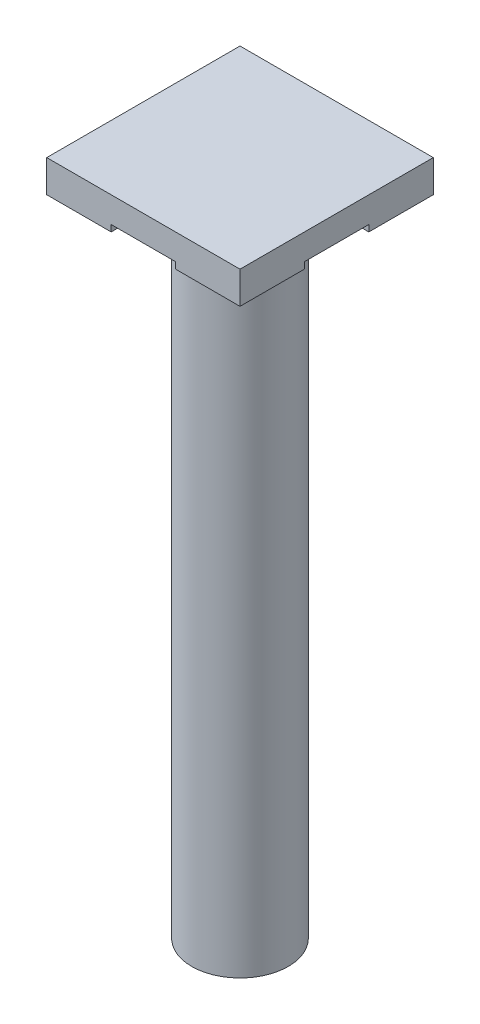
ISO-10303-21;
HEADER;
FILE_DESCRIPTION(('STEP AP214'),'2;1');
FILE_NAME('part.step','',(''),(''),'','','');
FILE_SCHEMA(('AUTOMOTIVE_DESIGN { 1 0 10303 214 1 1 1 1 }'));
ENDSEC;
DATA;
#1=APPLICATION_CONTEXT('core data for automotive mechanical design processes');
#2=APPLICATION_PROTOCOL_DEFINITION('international standard','automotive_design',2000,#1);
#3=PRODUCT_CONTEXT('',#1,'mechanical');
#4=PRODUCT('Part','Part','',(#3));
#5=PRODUCT_RELATED_PRODUCT_CATEGORY('part','',(#4));
#6=PRODUCT_DEFINITION_FORMATION('','',#4);
#7=PRODUCT_DEFINITION_CONTEXT('part definition',#1,'design');
#8=PRODUCT_DEFINITION('design','',#6,#7);
#9=PRODUCT_DEFINITION_SHAPE('','',#8);
#10=(LENGTH_UNIT() NAMED_UNIT(*) SI_UNIT(.MILLI.,.METRE.));
#11=(NAMED_UNIT(*) PLANE_ANGLE_UNIT() SI_UNIT($,.RADIAN.));
#12=(NAMED_UNIT(*) SI_UNIT($,.STERADIAN.) SOLID_ANGLE_UNIT());
#13=UNCERTAINTY_MEASURE_WITH_UNIT(LENGTH_MEASURE(1.E-05),#10,'distance_accuracy_value','');
#14=(GEOMETRIC_REPRESENTATION_CONTEXT(3) GLOBAL_UNCERTAINTY_ASSIGNED_CONTEXT((#13)) GLOBAL_UNIT_ASSIGNED_CONTEXT((#10,
#11,#12)) REPRESENTATION_CONTEXT('',''));
#15=CARTESIAN_POINT('',(0.,0.,0.));
#16=DIRECTION('',(0.,0.,1.));
#17=DIRECTION('',(1.,0.,0.));
#18=AXIS2_PLACEMENT_3D('',#15,#16,#17);
#19=CARTESIAN_POINT('',(0.,254.,0.));
#20=DIRECTION('',(0.,-1.,0.));
#21=DIRECTION('',(0.,0.,-1.));
#22=AXIS2_PLACEMENT_3D('',#19,#20,#21);
#23=CYLINDRICAL_SURFACE('',#22,19.05);
#24=CARTESIAN_POINT('',(0.,254.,0.));
#25=DIRECTION('',(0.,1.,0.));
#26=DIRECTION('',(0.,0.,1.));
#27=AXIS2_PLACEMENT_3D('',#24,#25,#26);
#28=CIRCLE('',#27,19.05);
#29=CARTESIAN_POINT('',(0.,254.,19.05));
#30=VERTEX_POINT('',#29);
#31=EDGE_CURVE('E11',#30,#30,#28,.T.);
#32=ORIENTED_EDGE('',*,*,#31,.F.);
#33=EDGE_LOOP('',(#32));
#34=FACE_BOUND('',#33,.T.);
#35=CARTESIAN_POINT('',(0.,0.,0.));
#36=DIRECTION('',(0.,1.,0.));
#37=DIRECTION('',(0.,0.,1.));
#38=AXIS2_PLACEMENT_3D('',#35,#36,#37);
#39=CIRCLE('',#38,19.05);
#40=CARTESIAN_POINT('',(0.,0.,19.05));
#41=VERTEX_POINT('',#40);
#42=EDGE_CURVE('E40',#41,#41,#39,.T.);
#43=ORIENTED_EDGE('',*,*,#42,.T.);
#44=EDGE_LOOP('',(#43));
#45=FACE_BOUND('',#44,.T.);
#46=ADVANCED_FACE('F37',(#34,#45),#23,.T.);
#47=CARTESIAN_POINT('',(0.,0.,0.));
#48=DIRECTION('',(0.,1.,0.));
#49=DIRECTION('',(0.,0.,1.));
#50=AXIS2_PLACEMENT_3D('',#47,#48,#49);
#51=PLANE('',#50);
#52=ORIENTED_EDGE('',*,*,#42,.F.);
#53=EDGE_LOOP('',(#52));
#54=FACE_BOUND('',#53,.T.);
#55=ADVANCED_FACE('F330',(#54),#51,.F.);
#56=CARTESIAN_POINT('',(-38.1,266.7,-38.1));
#57=DIRECTION('',(1.,0.,0.));
#58=DIRECTION('',(0.,0.,-1.));
#59=AXIS2_PLACEMENT_3D('',#56,#57,#58);
#60=PLANE('',#59);
#61=DIRECTION('',(0.,0.,-1.));
#62=VECTOR('',#61,1.);
#63=CARTESIAN_POINT('',(-38.1,256.54,12.7));
#64=LINE('',#63,#62);
#65=CARTESIAN_POINT('',(-38.1,256.54,12.7));
#66=VERTEX_POINT('',#65);
#67=CARTESIAN_POINT('',(-38.1,256.54,-12.7));
#68=VERTEX_POINT('',#67);
#69=EDGE_CURVE('E185',#66,#68,#64,.T.);
#70=ORIENTED_EDGE('',*,*,#69,.F.);
#71=DIRECTION('',(0.,-1.,0.));
#72=VECTOR('',#71,1.);
#73=CARTESIAN_POINT('',(-38.1,256.54,12.7));
#74=LINE('',#73,#72);
#75=CARTESIAN_POINT('',(-38.1,254.,12.7));
#76=VERTEX_POINT('',#75);
#77=EDGE_CURVE('E606',#66,#76,#74,.T.);
#78=ORIENTED_EDGE('',*,*,#77,.T.);
#79=DIRECTION('',(0.,0.,1.));
#80=VECTOR('',#79,1.);
#81=CARTESIAN_POINT('',(-38.1,254.,-38.1));
#82=LINE('',#81,#80);
#83=CARTESIAN_POINT('',(-38.1,254.,38.1));
#84=VERTEX_POINT('',#83);
#85=EDGE_CURVE('E304',#76,#84,#82,.T.);
#86=ORIENTED_EDGE('',*,*,#85,.T.);
#87=DIRECTION('',(0.,-1.,0.));
#88=VECTOR('',#87,1.);
#89=CARTESIAN_POINT('',(-38.1,266.7,38.1));
#90=LINE('',#89,#88);
#91=CARTESIAN_POINT('',(-38.1,266.7,38.1));
#92=VERTEX_POINT('',#91);
#93=EDGE_CURVE('E322',#92,#84,#90,.T.);
#94=ORIENTED_EDGE('',*,*,#93,.F.);
#95=DIRECTION('',(0.,0.,1.));
#96=VECTOR('',#95,1.);
#97=CARTESIAN_POINT('',(-38.1,266.7,-38.1));
#98=LINE('',#97,#96);
#99=CARTESIAN_POINT('',(-38.1,266.7,-38.1));
#100=VERTEX_POINT('',#99);
#101=EDGE_CURVE('E291',#100,#92,#98,.T.);
#102=ORIENTED_EDGE('',*,*,#101,.F.);
#103=DIRECTION('',(0.,-1.,0.));
#104=VECTOR('',#103,1.);
#105=CARTESIAN_POINT('',(-38.1,266.7,-38.1));
#106=LINE('',#105,#104);
#107=CARTESIAN_POINT('',(-38.1,254.,-38.1));
#108=VERTEX_POINT('',#107);
#109=EDGE_CURVE('E301',#100,#108,#106,.T.);
#110=ORIENTED_EDGE('',*,*,#109,.T.);
#111=CARTESIAN_POINT('',(-38.1,254.,-12.7));
#112=VERTEX_POINT('',#111);
#113=EDGE_CURVE('E200',#108,#112,#82,.T.);
#114=ORIENTED_EDGE('',*,*,#113,.T.);
#115=DIRECTION('',(0.,-1.,0.));
#116=VECTOR('',#115,1.);
#117=CARTESIAN_POINT('',(-38.1,256.54,-12.7));
#118=LINE('',#117,#116);
#119=EDGE_CURVE('E178',#68,#112,#118,.T.);
#120=ORIENTED_EDGE('',*,*,#119,.F.);
#121=EDGE_LOOP('',(#70,#78,#86,#94,#102,#110,#114,#120));
#122=FACE_BOUND('',#121,.T.);
#123=ADVANCED_FACE('F197',(#122),#60,.F.);
#124=CARTESIAN_POINT('',(-38.1,266.7,38.1));
#125=DIRECTION('',(0.,0.,-1.));
#126=DIRECTION('',(-1.,0.,0.));
#127=AXIS2_PLACEMENT_3D('',#124,#125,#126);
#128=PLANE('',#127);
#129=DIRECTION('',(1.,0.,0.));
#130=VECTOR('',#129,1.);
#131=CARTESIAN_POINT('',(-38.1,254.,38.1));
#132=LINE('',#131,#130);
#133=CARTESIAN_POINT('',(-12.7,254.,38.1));
#134=VERTEX_POINT('',#133);
#135=EDGE_CURVE('E305',#84,#134,#132,.T.);
#136=ORIENTED_EDGE('',*,*,#135,.T.);
#137=DIRECTION('',(0.,-1.,0.));
#138=VECTOR('',#137,1.);
#139=CARTESIAN_POINT('',(-12.7,256.54,38.1));
#140=LINE('',#139,#138);
#141=CARTESIAN_POINT('',(-12.7,256.54,38.1));
#142=VERTEX_POINT('',#141);
#143=EDGE_CURVE('E215',#142,#134,#140,.T.);
#144=ORIENTED_EDGE('',*,*,#143,.F.);
#145=DIRECTION('',(-1.,0.,0.));
#146=VECTOR('',#145,1.);
#147=CARTESIAN_POINT('',(-12.7,256.54,38.1));
#148=LINE('',#147,#146);
#149=CARTESIAN_POINT('',(12.7,256.54,38.1));
#150=VERTEX_POINT('',#149);
#151=EDGE_CURVE('E209',#150,#142,#148,.T.);
#152=ORIENTED_EDGE('',*,*,#151,.F.);
#153=DIRECTION('',(0.,-1.,0.));
#154=VECTOR('',#153,1.);
#155=CARTESIAN_POINT('',(12.7,256.54,38.1));
#156=LINE('',#155,#154);
#157=CARTESIAN_POINT('',(12.7,254.,38.1));
#158=VERTEX_POINT('',#157);
#159=EDGE_CURVE('E212',#150,#158,#156,.T.);
#160=ORIENTED_EDGE('',*,*,#159,.T.);
#161=CARTESIAN_POINT('',(38.1,254.,38.1));
#162=VERTEX_POINT('',#161);
#163=EDGE_CURVE('E303',#158,#162,#132,.T.);
#164=ORIENTED_EDGE('',*,*,#163,.T.);
#165=DIRECTION('',(0.,-1.,0.));
#166=VECTOR('',#165,1.);
#167=CARTESIAN_POINT('',(38.1,266.7,38.1));
#168=LINE('',#167,#166);
#169=CARTESIAN_POINT('',(38.1,266.7,38.1));
#170=VERTEX_POINT('',#169);
#171=EDGE_CURVE('E319',#170,#162,#168,.T.);
#172=ORIENTED_EDGE('',*,*,#171,.F.);
#173=DIRECTION('',(1.,0.,0.));
#174=VECTOR('',#173,1.);
#175=CARTESIAN_POINT('',(-38.1,266.7,38.1));
#176=LINE('',#175,#174);
#177=EDGE_CURVE('E294',#92,#170,#176,.T.);
#178=ORIENTED_EDGE('',*,*,#177,.F.);
#179=ORIENTED_EDGE('',*,*,#93,.T.);
#180=EDGE_LOOP('',(#136,#144,#152,#160,#164,#172,#178,#179));
#181=FACE_BOUND('',#180,.T.);
#182=ADVANCED_FACE('F336',(#181),#128,.F.);
#183=CARTESIAN_POINT('',(38.1,266.7,-38.1));
#184=DIRECTION('',(-1.,0.,0.));
#185=DIRECTION('',(0.,0.,1.));
#186=AXIS2_PLACEMENT_3D('',#183,#184,#185);
#187=PLANE('',#186);
#188=DIRECTION('',(0.,0.,1.));
#189=VECTOR('',#188,1.);
#190=CARTESIAN_POINT('',(38.1,256.54,12.7));
#191=LINE('',#190,#189);
#192=CARTESIAN_POINT('',(38.1,256.54,-12.7));
#193=VERTEX_POINT('',#192);
#194=CARTESIAN_POINT('',(38.1,256.54,12.7));
#195=VERTEX_POINT('',#194);
#196=EDGE_CURVE('E249',#193,#195,#191,.T.);
#197=ORIENTED_EDGE('',*,*,#196,.F.);
#198=DIRECTION('',(0.,-1.,0.));
#199=VECTOR('',#198,1.);
#200=CARTESIAN_POINT('',(38.1,256.54,-12.7));
#201=LINE('',#200,#199);
#202=CARTESIAN_POINT('',(38.1,254.,-12.7));
#203=VERTEX_POINT('',#202);
#204=EDGE_CURVE('E242',#193,#203,#201,.T.);
#205=ORIENTED_EDGE('',*,*,#204,.T.);
#206=DIRECTION('',(0.,0.,-1.));
#207=VECTOR('',#206,1.);
#208=CARTESIAN_POINT('',(38.1,254.,-38.1));
#209=LINE('',#208,#207);
#210=CARTESIAN_POINT('',(38.1,254.,-38.1));
#211=VERTEX_POINT('',#210);
#212=EDGE_CURVE('E308',#203,#211,#209,.T.);
#213=ORIENTED_EDGE('',*,*,#212,.T.);
#214=DIRECTION('',(0.,-1.,0.));
#215=VECTOR('',#214,1.);
#216=CARTESIAN_POINT('',(38.1,266.7,-38.1));
#217=LINE('',#216,#215);
#218=CARTESIAN_POINT('',(38.1,266.7,-38.1));
#219=VERTEX_POINT('',#218);
#220=EDGE_CURVE('E316',#219,#211,#217,.T.);
#221=ORIENTED_EDGE('',*,*,#220,.F.);
#222=DIRECTION('',(0.,0.,-1.));
#223=VECTOR('',#222,1.);
#224=CARTESIAN_POINT('',(38.1,266.7,-38.1));
#225=LINE('',#224,#223);
#226=EDGE_CURVE('E297',#170,#219,#225,.T.);
#227=ORIENTED_EDGE('',*,*,#226,.F.);
#228=ORIENTED_EDGE('',*,*,#171,.T.);
#229=CARTESIAN_POINT('',(38.1,254.,12.7));
#230=VERTEX_POINT('',#229);
#231=EDGE_CURVE('E309',#162,#230,#209,.T.);
#232=ORIENTED_EDGE('',*,*,#231,.T.);
#233=DIRECTION('',(0.,-1.,0.));
#234=VECTOR('',#233,1.);
#235=CARTESIAN_POINT('',(38.1,256.54,12.7));
#236=LINE('',#235,#234);
#237=EDGE_CURVE('E59',#195,#230,#236,.T.);
#238=ORIENTED_EDGE('',*,*,#237,.F.);
#239=EDGE_LOOP('',(#197,#205,#213,#221,#227,#228,#232,#238));
#240=FACE_BOUND('',#239,.T.);
#241=ADVANCED_FACE('F342',(#240),#187,.F.);
#242=CARTESIAN_POINT('',(-38.1,266.7,-38.1));
#243=DIRECTION('',(0.,0.,1.));
#244=DIRECTION('',(1.,0.,0.));
#245=AXIS2_PLACEMENT_3D('',#242,#243,#244);
#246=PLANE('',#245);
#247=DIRECTION('',(1.,0.,0.));
#248=VECTOR('',#247,1.);
#249=CARTESIAN_POINT('',(-12.7,256.54,-38.1));
#250=LINE('',#249,#248);
#251=CARTESIAN_POINT('',(-12.7,256.54,-38.1));
#252=VERTEX_POINT('',#251);
#253=CARTESIAN_POINT('',(12.7,256.54,-38.1));
#254=VERTEX_POINT('',#253);
#255=EDGE_CURVE('E286',#252,#254,#250,.T.);
#256=ORIENTED_EDGE('',*,*,#255,.F.);
#257=DIRECTION('',(0.,-1.,0.));
#258=VECTOR('',#257,1.);
#259=CARTESIAN_POINT('',(-12.7,256.54,-38.1));
#260=LINE('',#259,#258);
#261=CARTESIAN_POINT('',(-12.7,254.,-38.1));
#262=VERTEX_POINT('',#261);
#263=EDGE_CURVE('E263',#252,#262,#260,.T.);
#264=ORIENTED_EDGE('',*,*,#263,.T.);
#265=DIRECTION('',(-1.,0.,0.));
#266=VECTOR('',#265,1.);
#267=CARTESIAN_POINT('',(-38.1,254.,-38.1));
#268=LINE('',#267,#266);
#269=EDGE_CURVE('E312',#262,#108,#268,.T.);
#270=ORIENTED_EDGE('',*,*,#269,.T.);
#271=ORIENTED_EDGE('',*,*,#109,.F.);
#272=DIRECTION('',(-1.,0.,0.));
#273=VECTOR('',#272,1.);
#274=CARTESIAN_POINT('',(-38.1,266.7,-38.1));
#275=LINE('',#274,#273);
#276=EDGE_CURVE('E299',#219,#100,#275,.T.);
#277=ORIENTED_EDGE('',*,*,#276,.F.);
#278=ORIENTED_EDGE('',*,*,#220,.T.);
#279=CARTESIAN_POINT('',(12.7,254.,-38.1));
#280=VERTEX_POINT('',#279);
#281=EDGE_CURVE('E295',#211,#280,#268,.T.);
#282=ORIENTED_EDGE('',*,*,#281,.T.);
#283=DIRECTION('',(0.,-1.,0.));
#284=VECTOR('',#283,1.);
#285=CARTESIAN_POINT('',(12.7,256.54,-38.1));
#286=LINE('',#285,#284);
#287=EDGE_CURVE('E267',#254,#280,#286,.T.);
#288=ORIENTED_EDGE('',*,*,#287,.F.);
#289=EDGE_LOOP('',(#256,#264,#270,#271,#277,#278,#282,#288));
#290=FACE_BOUND('',#289,.T.);
#291=ADVANCED_FACE('F345',(#290),#246,.F.);
#292=CARTESIAN_POINT('',(0.,266.7,0.));
#293=DIRECTION('',(0.,1.,0.));
#294=DIRECTION('',(0.,0.,1.));
#295=AXIS2_PLACEMENT_3D('',#292,#293,#294);
#296=PLANE('',#295);
#297=ORIENTED_EDGE('',*,*,#101,.T.);
#298=ORIENTED_EDGE('',*,*,#177,.T.);
#299=ORIENTED_EDGE('',*,*,#226,.T.);
#300=ORIENTED_EDGE('',*,*,#276,.T.);
#301=EDGE_LOOP('',(#297,#298,#299,#300));
#302=FACE_BOUND('',#301,.T.);
#303=ADVANCED_FACE('F349',(#302),#296,.T.);
#304=CARTESIAN_POINT('',(0.,254.,0.));
#305=DIRECTION('',(0.,1.,0.));
#306=DIRECTION('',(0.,0.,1.));
#307=AXIS2_PLACEMENT_3D('',#304,#305,#306);
#308=PLANE('',#307);
#309=ORIENTED_EDGE('',*,*,#31,.T.);
#310=EDGE_LOOP('',(#309));
#311=FACE_BOUND('',#310,.T.);
#312=ORIENTED_EDGE('',*,*,#85,.F.);
#313=DIRECTION('',(-1.,0.,0.));
#314=VECTOR('',#313,1.);
#315=CARTESIAN_POINT('',(-38.1,254.,12.7));
#316=LINE('',#315,#314);
#317=CARTESIAN_POINT('',(-29.21,254.,12.7));
#318=VERTEX_POINT('',#317);
#319=EDGE_CURVE('E194',#318,#76,#316,.T.);
#320=ORIENTED_EDGE('',*,*,#319,.F.);
#321=DIRECTION('',(0.,0.,1.));
#322=VECTOR('',#321,1.);
#323=CARTESIAN_POINT('',(-29.21,254.,12.7));
#324=LINE('',#323,#322);
#325=CARTESIAN_POINT('',(-29.21,254.,-12.7));
#326=VERTEX_POINT('',#325);
#327=EDGE_CURVE('E611',#326,#318,#324,.T.);
#328=ORIENTED_EDGE('',*,*,#327,.F.);
#329=DIRECTION('',(1.,0.,0.));
#330=VECTOR('',#329,1.);
#331=CARTESIAN_POINT('',(-38.1,254.,-12.7));
#332=LINE('',#331,#330);
#333=EDGE_CURVE('E225',#112,#326,#332,.T.);
#334=ORIENTED_EDGE('',*,*,#333,.F.);
#335=ORIENTED_EDGE('',*,*,#113,.F.);
#336=ORIENTED_EDGE('',*,*,#269,.F.);
#337=DIRECTION('',(0.,0.,-1.));
#338=VECTOR('',#337,1.);
#339=CARTESIAN_POINT('',(-12.7,254.,-38.1));
#340=LINE('',#339,#338);
#341=CARTESIAN_POINT('',(-12.7,254.,-29.21));
#342=VERTEX_POINT('',#341);
#343=EDGE_CURVE('E245',#342,#262,#340,.T.);
#344=ORIENTED_EDGE('',*,*,#343,.F.);
#345=DIRECTION('',(-1.,0.,0.));
#346=VECTOR('',#345,1.);
#347=CARTESIAN_POINT('',(-12.7,254.,-29.21));
#348=LINE('',#347,#346);
#349=CARTESIAN_POINT('',(12.7,254.,-29.21));
#350=VERTEX_POINT('',#349);
#351=EDGE_CURVE('E273',#350,#342,#348,.T.);
#352=ORIENTED_EDGE('',*,*,#351,.F.);
#353=DIRECTION('',(0.,0.,1.));
#354=VECTOR('',#353,1.);
#355=CARTESIAN_POINT('',(12.7,254.,-38.1));
#356=LINE('',#355,#354);
#357=EDGE_CURVE('E276',#280,#350,#356,.T.);
#358=ORIENTED_EDGE('',*,*,#357,.F.);
#359=ORIENTED_EDGE('',*,*,#281,.F.);
#360=ORIENTED_EDGE('',*,*,#212,.F.);
#361=DIRECTION('',(1.,0.,0.));
#362=VECTOR('',#361,1.);
#363=CARTESIAN_POINT('',(38.1,254.,-12.7));
#364=LINE('',#363,#362);
#365=CARTESIAN_POINT('',(29.21,254.,-12.7));
#366=VERTEX_POINT('',#365);
#367=EDGE_CURVE('E246',#366,#203,#364,.T.);
#368=ORIENTED_EDGE('',*,*,#367,.F.);
#369=DIRECTION('',(0.,0.,-1.));
#370=VECTOR('',#369,1.);
#371=CARTESIAN_POINT('',(29.21,254.,12.7));
#372=LINE('',#371,#370);
#373=CARTESIAN_POINT('',(29.21,254.,12.7));
#374=VERTEX_POINT('',#373);
#375=EDGE_CURVE('E248',#374,#366,#372,.T.);
#376=ORIENTED_EDGE('',*,*,#375,.F.);
#377=DIRECTION('',(-1.,0.,0.));
#378=VECTOR('',#377,1.);
#379=CARTESIAN_POINT('',(38.1,254.,12.7));
#380=LINE('',#379,#378);
#381=EDGE_CURVE('E217',#230,#374,#380,.T.);
#382=ORIENTED_EDGE('',*,*,#381,.F.);
#383=ORIENTED_EDGE('',*,*,#231,.F.);
#384=ORIENTED_EDGE('',*,*,#163,.F.);
#385=DIRECTION('',(0.,0.,1.));
#386=VECTOR('',#385,1.);
#387=CARTESIAN_POINT('',(12.7,254.,38.1));
#388=LINE('',#387,#386);
#389=CARTESIAN_POINT('',(12.7,254.,29.21));
#390=VERTEX_POINT('',#389);
#391=EDGE_CURVE('E218',#390,#158,#388,.T.);
#392=ORIENTED_EDGE('',*,*,#391,.F.);
#393=DIRECTION('',(1.,0.,0.));
#394=VECTOR('',#393,1.);
#395=CARTESIAN_POINT('',(-12.7,254.,29.21));
#396=LINE('',#395,#394);
#397=CARTESIAN_POINT('',(-12.7,254.,29.21));
#398=VERTEX_POINT('',#397);
#399=EDGE_CURVE('E220',#398,#390,#396,.T.);
#400=ORIENTED_EDGE('',*,*,#399,.F.);
#401=DIRECTION('',(0.,0.,-1.));
#402=VECTOR('',#401,1.);
#403=CARTESIAN_POINT('',(-12.7,254.,38.1));
#404=LINE('',#403,#402);
#405=EDGE_CURVE('E51',#134,#398,#404,.T.);
#406=ORIENTED_EDGE('',*,*,#405,.F.);
#407=ORIENTED_EDGE('',*,*,#135,.F.);
#408=EDGE_LOOP('',(#312,#320,#328,#334,#335,#336,#344,#352,#358,#359,#360,#368,#376,#382,#383,
#384,#392,#400,#406,#407));
#409=FACE_BOUND('',#408,.T.);
#410=ADVANCED_FACE('F351',(#311,#409),#308,.F.);
#411=CARTESIAN_POINT('',(-12.7,256.54,-38.1));
#412=DIRECTION('',(-1.,0.,0.));
#413=DIRECTION('',(0.,0.,1.));
#414=AXIS2_PLACEMENT_3D('',#411,#412,#413);
#415=PLANE('',#414);
#416=ORIENTED_EDGE('',*,*,#343,.T.);
#417=ORIENTED_EDGE('',*,*,#263,.F.);
#418=DIRECTION('',(0.,0.,-1.));
#419=VECTOR('',#418,1.);
#420=CARTESIAN_POINT('',(-12.7,256.54,-38.1));
#421=LINE('',#420,#419);
#422=CARTESIAN_POINT('',(-12.7,256.54,-29.21));
#423=VERTEX_POINT('',#422);
#424=EDGE_CURVE('E277',#423,#252,#421,.T.);
#425=ORIENTED_EDGE('',*,*,#424,.F.);
#426=DIRECTION('',(0.,-1.,0.));
#427=VECTOR('',#426,1.);
#428=CARTESIAN_POINT('',(-12.7,256.54,-29.21));
#429=LINE('',#428,#427);
#430=EDGE_CURVE('E271',#423,#342,#429,.T.);
#431=ORIENTED_EDGE('',*,*,#430,.T.);
#432=EDGE_LOOP('',(#416,#417,#425,#431));
#433=FACE_BOUND('',#432,.T.);
#434=ADVANCED_FACE('F354',(#433),#415,.F.);
#435=CARTESIAN_POINT('',(-12.7,256.54,-29.21));
#436=DIRECTION('',(0.,0.,1.));
#437=DIRECTION('',(1.,0.,0.));
#438=AXIS2_PLACEMENT_3D('',#435,#436,#437);
#439=PLANE('',#438);
#440=ORIENTED_EDGE('',*,*,#351,.T.);
#441=ORIENTED_EDGE('',*,*,#430,.F.);
#442=DIRECTION('',(-1.,0.,0.));
#443=VECTOR('',#442,1.);
#444=CARTESIAN_POINT('',(-12.7,256.54,-29.21));
#445=LINE('',#444,#443);
#446=CARTESIAN_POINT('',(12.7,256.54,-29.21));
#447=VERTEX_POINT('',#446);
#448=EDGE_CURVE('E266',#447,#423,#445,.T.);
#449=ORIENTED_EDGE('',*,*,#448,.F.);
#450=DIRECTION('',(0.,-1.,0.));
#451=VECTOR('',#450,1.);
#452=CARTESIAN_POINT('',(12.7,256.54,-29.21));
#453=LINE('',#452,#451);
#454=EDGE_CURVE('E269',#447,#350,#453,.T.);
#455=ORIENTED_EDGE('',*,*,#454,.T.);
#456=EDGE_LOOP('',(#440,#441,#449,#455));
#457=FACE_BOUND('',#456,.T.);
#458=ADVANCED_FACE('F365',(#457),#439,.F.);
#459=CARTESIAN_POINT('',(12.7,256.54,-38.1));
#460=DIRECTION('',(1.,0.,0.));
#461=DIRECTION('',(0.,0.,-1.));
#462=AXIS2_PLACEMENT_3D('',#459,#460,#461);
#463=PLANE('',#462);
#464=ORIENTED_EDGE('',*,*,#357,.T.);
#465=ORIENTED_EDGE('',*,*,#454,.F.);
#466=DIRECTION('',(0.,0.,1.));
#467=VECTOR('',#466,1.);
#468=CARTESIAN_POINT('',(12.7,256.54,-38.1));
#469=LINE('',#468,#467);
#470=EDGE_CURVE('E283',#254,#447,#469,.T.);
#471=ORIENTED_EDGE('',*,*,#470,.F.);
#472=ORIENTED_EDGE('',*,*,#287,.T.);
#473=EDGE_LOOP('',(#464,#465,#471,#472));
#474=FACE_BOUND('',#473,.T.);
#475=ADVANCED_FACE('F363',(#474),#463,.F.);
#476=CARTESIAN_POINT('',(0.,256.54,0.));
#477=DIRECTION('',(0.,1.,0.));
#478=DIRECTION('',(0.,0.,1.));
#479=AXIS2_PLACEMENT_3D('',#476,#477,#478);
#480=PLANE('',#479);
#481=ORIENTED_EDGE('',*,*,#424,.T.);
#482=ORIENTED_EDGE('',*,*,#255,.T.);
#483=ORIENTED_EDGE('',*,*,#470,.T.);
#484=ORIENTED_EDGE('',*,*,#448,.T.);
#485=EDGE_LOOP('',(#481,#482,#483,#484));
#486=FACE_BOUND('',#485,.T.);
#487=ADVANCED_FACE('F359',(#486),#480,.F.);
#488=CARTESIAN_POINT('',(38.1,256.54,-12.7));
#489=DIRECTION('',(0.,0.,-1.));
#490=DIRECTION('',(-1.,0.,0.));
#491=AXIS2_PLACEMENT_3D('',#488,#489,#490);
#492=PLANE('',#491);
#493=ORIENTED_EDGE('',*,*,#367,.T.);
#494=ORIENTED_EDGE('',*,*,#204,.F.);
#495=DIRECTION('',(1.,0.,0.));
#496=VECTOR('',#495,1.);
#497=CARTESIAN_POINT('',(38.1,256.54,-12.7));
#498=LINE('',#497,#496);
#499=CARTESIAN_POINT('',(29.21,256.54,-12.7));
#500=VERTEX_POINT('',#499);
#501=EDGE_CURVE('E237',#500,#193,#498,.T.);
#502=ORIENTED_EDGE('',*,*,#501,.F.);
#503=DIRECTION('',(0.,-1.,0.));
#504=VECTOR('',#503,1.);
#505=CARTESIAN_POINT('',(29.21,256.54,-12.7));
#506=LINE('',#505,#504);
#507=EDGE_CURVE('E240',#500,#366,#506,.T.);
#508=ORIENTED_EDGE('',*,*,#507,.T.);
#509=EDGE_LOOP('',(#493,#494,#502,#508));
#510=FACE_BOUND('',#509,.T.);
#511=ADVANCED_FACE('F362',(#510),#492,.F.);
#512=CARTESIAN_POINT('',(29.21,256.54,12.7));
#513=DIRECTION('',(-1.,0.,0.));
#514=DIRECTION('',(0.,0.,1.));
#515=AXIS2_PLACEMENT_3D('',#512,#513,#514);
#516=PLANE('',#515);
#517=ORIENTED_EDGE('',*,*,#375,.T.);
#518=ORIENTED_EDGE('',*,*,#507,.F.);
#519=DIRECTION('',(0.,0.,-1.));
#520=VECTOR('',#519,1.);
#521=CARTESIAN_POINT('',(29.21,256.54,12.7));
#522=LINE('',#521,#520);
#523=CARTESIAN_POINT('',(29.21,256.54,12.7));
#524=VERTEX_POINT('',#523);
#525=EDGE_CURVE('E255',#524,#500,#522,.T.);
#526=ORIENTED_EDGE('',*,*,#525,.F.);
#527=DIRECTION('',(0.,-1.,0.));
#528=VECTOR('',#527,1.);
#529=CARTESIAN_POINT('',(29.21,256.54,12.7));
#530=LINE('',#529,#528);
#531=EDGE_CURVE('E238',#524,#374,#530,.T.);
#532=ORIENTED_EDGE('',*,*,#531,.T.);
#533=EDGE_LOOP('',(#517,#518,#526,#532));
#534=FACE_BOUND('',#533,.T.);
#535=ADVANCED_FACE('F383',(#534),#516,.F.);
#536=CARTESIAN_POINT('',(38.1,256.54,12.7));
#537=DIRECTION('',(0.,0.,1.));
#538=DIRECTION('',(1.,0.,0.));
#539=AXIS2_PLACEMENT_3D('',#536,#537,#538);
#540=PLANE('',#539);
#541=ORIENTED_EDGE('',*,*,#381,.T.);
#542=ORIENTED_EDGE('',*,*,#531,.F.);
#543=DIRECTION('',(-1.,0.,0.));
#544=VECTOR('',#543,1.);
#545=CARTESIAN_POINT('',(38.1,256.54,12.7));
#546=LINE('',#545,#544);
#547=EDGE_CURVE('E258',#195,#524,#546,.T.);
#548=ORIENTED_EDGE('',*,*,#547,.F.);
#549=ORIENTED_EDGE('',*,*,#237,.T.);
#550=EDGE_LOOP('',(#541,#542,#548,#549));
#551=FACE_BOUND('',#550,.T.);
#552=ADVANCED_FACE('F379',(#551),#540,.F.);
#553=CARTESIAN_POINT('',(0.,256.54,0.));
#554=DIRECTION('',(0.,1.,0.));
#555=DIRECTION('',(0.,0.,1.));
#556=AXIS2_PLACEMENT_3D('',#553,#554,#555);
#557=PLANE('',#556);
#558=ORIENTED_EDGE('',*,*,#196,.T.);
#559=ORIENTED_EDGE('',*,*,#547,.T.);
#560=ORIENTED_EDGE('',*,*,#525,.T.);
#561=ORIENTED_EDGE('',*,*,#501,.T.);
#562=EDGE_LOOP('',(#558,#559,#560,#561));
#563=FACE_BOUND('',#562,.T.);
#564=ADVANCED_FACE('F375',(#563),#557,.F.);
#565=CARTESIAN_POINT('',(-12.7,256.54,38.1));
#566=DIRECTION('',(-1.,0.,0.));
#567=DIRECTION('',(0.,0.,1.));
#568=AXIS2_PLACEMENT_3D('',#565,#566,#567);
#569=PLANE('',#568);
#570=ORIENTED_EDGE('',*,*,#405,.T.);
#571=DIRECTION('',(0.,-1.,0.));
#572=VECTOR('',#571,1.);
#573=CARTESIAN_POINT('',(-12.7,256.54,29.21));
#574=LINE('',#573,#572);
#575=CARTESIAN_POINT('',(-12.7,256.54,29.21));
#576=VERTEX_POINT('',#575);
#577=EDGE_CURVE('E207',#576,#398,#574,.T.);
#578=ORIENTED_EDGE('',*,*,#577,.F.);
#579=DIRECTION('',(0.,0.,-1.));
#580=VECTOR('',#579,1.);
#581=CARTESIAN_POINT('',(-12.7,256.54,38.1));
#582=LINE('',#581,#580);
#583=EDGE_CURVE('E221',#142,#576,#582,.T.);
#584=ORIENTED_EDGE('',*,*,#583,.F.);
#585=ORIENTED_EDGE('',*,*,#143,.T.);
#586=EDGE_LOOP('',(#570,#578,#584,#585));
#587=FACE_BOUND('',#586,.T.);
#588=ADVANCED_FACE('F378',(#587),#569,.F.);
#589=CARTESIAN_POINT('',(12.7,256.54,38.1));
#590=DIRECTION('',(1.,0.,0.));
#591=DIRECTION('',(0.,0.,-1.));
#592=AXIS2_PLACEMENT_3D('',#589,#590,#591);
#593=PLANE('',#592);
#594=ORIENTED_EDGE('',*,*,#391,.T.);
#595=ORIENTED_EDGE('',*,*,#159,.F.);
#596=DIRECTION('',(0.,0.,1.));
#597=VECTOR('',#596,1.);
#598=CARTESIAN_POINT('',(12.7,256.54,38.1));
#599=LINE('',#598,#597);
#600=CARTESIAN_POINT('',(12.7,256.54,29.21));
#601=VERTEX_POINT('',#600);
#602=EDGE_CURVE('E228',#601,#150,#599,.T.);
#603=ORIENTED_EDGE('',*,*,#602,.F.);
#604=DIRECTION('',(0.,-1.,0.));
#605=VECTOR('',#604,1.);
#606=CARTESIAN_POINT('',(12.7,256.54,29.21));
#607=LINE('',#606,#605);
#608=EDGE_CURVE('E210',#601,#390,#607,.T.);
#609=ORIENTED_EDGE('',*,*,#608,.T.);
#610=EDGE_LOOP('',(#594,#595,#603,#609));
#611=FACE_BOUND('',#610,.T.);
#612=ADVANCED_FACE('F396',(#611),#593,.F.);
#613=CARTESIAN_POINT('',(-12.7,256.54,29.21));
#614=DIRECTION('',(0.,0.,-1.));
#615=DIRECTION('',(-1.,0.,0.));
#616=AXIS2_PLACEMENT_3D('',#613,#614,#615);
#617=PLANE('',#616);
#618=ORIENTED_EDGE('',*,*,#399,.T.);
#619=ORIENTED_EDGE('',*,*,#608,.F.);
#620=DIRECTION('',(1.,0.,0.));
#621=VECTOR('',#620,1.);
#622=CARTESIAN_POINT('',(-12.7,256.54,29.21));
#623=LINE('',#622,#621);
#624=EDGE_CURVE('E231',#576,#601,#623,.T.);
#625=ORIENTED_EDGE('',*,*,#624,.F.);
#626=ORIENTED_EDGE('',*,*,#577,.T.);
#627=EDGE_LOOP('',(#618,#619,#625,#626));
#628=FACE_BOUND('',#627,.T.);
#629=ADVANCED_FACE('F394',(#628),#617,.F.);
#630=CARTESIAN_POINT('',(0.,256.54,0.));
#631=DIRECTION('',(0.,-1.,0.));
#632=DIRECTION('',(0.,0.,-1.));
#633=AXIS2_PLACEMENT_3D('',#630,#631,#632);
#634=PLANE('',#633);
#635=ORIENTED_EDGE('',*,*,#583,.T.);
#636=ORIENTED_EDGE('',*,*,#624,.T.);
#637=ORIENTED_EDGE('',*,*,#602,.T.);
#638=ORIENTED_EDGE('',*,*,#151,.T.);
#639=EDGE_LOOP('',(#635,#636,#637,#638));
#640=FACE_BOUND('',#639,.T.);
#641=ADVANCED_FACE('F390',(#640),#634,.T.);
#642=CARTESIAN_POINT('',(-38.1,256.54,12.7));
#643=DIRECTION('',(0.,0.,1.));
#644=DIRECTION('',(1.,0.,0.));
#645=AXIS2_PLACEMENT_3D('',#642,#643,#644);
#646=PLANE('',#645);
#647=ORIENTED_EDGE('',*,*,#319,.T.);
#648=ORIENTED_EDGE('',*,*,#77,.F.);
#649=DIRECTION('',(-1.,0.,0.));
#650=VECTOR('',#649,1.);
#651=CARTESIAN_POINT('',(-38.1,256.54,12.7));
#652=LINE('',#651,#650);
#653=CARTESIAN_POINT('',(-29.21,256.54,12.7));
#654=VERTEX_POINT('',#653);
#655=EDGE_CURVE('E191',#654,#66,#652,.T.);
#656=ORIENTED_EDGE('',*,*,#655,.F.);
#657=DIRECTION('',(0.,-1.,0.));
#658=VECTOR('',#657,1.);
#659=CARTESIAN_POINT('',(-29.21,256.54,12.7));
#660=LINE('',#659,#658);
#661=EDGE_CURVE('E202',#654,#318,#660,.T.);
#662=ORIENTED_EDGE('',*,*,#661,.T.);
#663=EDGE_LOOP('',(#647,#648,#656,#662));
#664=FACE_BOUND('',#663,.T.);
#665=ADVANCED_FACE('F393',(#664),#646,.F.);
#666=CARTESIAN_POINT('',(-29.21,256.54,12.7));
#667=DIRECTION('',(1.,0.,0.));
#668=DIRECTION('',(0.,0.,-1.));
#669=AXIS2_PLACEMENT_3D('',#666,#667,#668);
#670=PLANE('',#669);
#671=ORIENTED_EDGE('',*,*,#327,.T.);
#672=ORIENTED_EDGE('',*,*,#661,.F.);
#673=DIRECTION('',(0.,0.,1.));
#674=VECTOR('',#673,1.);
#675=CARTESIAN_POINT('',(-29.21,256.54,12.7));
#676=LINE('',#675,#674);
#677=CARTESIAN_POINT('',(-29.21,256.54,-12.7));
#678=VERTEX_POINT('',#677);
#679=EDGE_CURVE('E184',#678,#654,#676,.T.);
#680=ORIENTED_EDGE('',*,*,#679,.F.);
#681=DIRECTION('',(0.,-1.,0.));
#682=VECTOR('',#681,1.);
#683=CARTESIAN_POINT('',(-29.21,256.54,-12.7));
#684=LINE('',#683,#682);
#685=EDGE_CURVE('E180',#678,#326,#684,.T.);
#686=ORIENTED_EDGE('',*,*,#685,.T.);
#687=EDGE_LOOP('',(#671,#672,#680,#686));
#688=FACE_BOUND('',#687,.T.);
#689=ADVANCED_FACE('F407',(#688),#670,.F.);
#690=CARTESIAN_POINT('',(-38.1,256.54,-12.7));
#691=DIRECTION('',(0.,0.,-1.));
#692=DIRECTION('',(-1.,0.,0.));
#693=AXIS2_PLACEMENT_3D('',#690,#691,#692);
#694=PLANE('',#693);
#695=ORIENTED_EDGE('',*,*,#333,.T.);
#696=ORIENTED_EDGE('',*,*,#685,.F.);
#697=DIRECTION('',(1.,0.,0.));
#698=VECTOR('',#697,1.);
#699=CARTESIAN_POINT('',(-38.1,256.54,-12.7));
#700=LINE('',#699,#698);
#701=EDGE_CURVE('E173',#68,#678,#700,.T.);
#702=ORIENTED_EDGE('',*,*,#701,.F.);
#703=ORIENTED_EDGE('',*,*,#119,.T.);
#704=EDGE_LOOP('',(#695,#696,#702,#703));
#705=FACE_BOUND('',#704,.T.);
#706=ADVANCED_FACE('F176',(#705),#694,.F.);
#707=CARTESIAN_POINT('',(0.,256.54,0.));
#708=DIRECTION('',(0.,-1.,0.));
#709=DIRECTION('',(0.,0.,-1.));
#710=AXIS2_PLACEMENT_3D('',#707,#708,#709);
#711=PLANE('',#710);
#712=ORIENTED_EDGE('',*,*,#69,.T.);
#713=ORIENTED_EDGE('',*,*,#701,.T.);
#714=ORIENTED_EDGE('',*,*,#679,.T.);
#715=ORIENTED_EDGE('',*,*,#655,.T.);
#716=EDGE_LOOP('',(#712,#713,#714,#715));
#717=FACE_BOUND('',#716,.T.);
#718=ADVANCED_FACE('F189',(#717),#711,.T.);
#719=CLOSED_SHELL('',(#46,#55,#123,#182,#241,#291,#303,#410,#434,#458,#475,#487,#511,#535,#552,
#564,#588,#612,#629,#641,#665,#689,#706,#718));
#720=MANIFOLD_SOLID_BREP('B2',#719);
#721=ADVANCED_BREP_SHAPE_REPRESENTATION('',(#18,#720),#14);
#722=SHAPE_DEFINITION_REPRESENTATION(#9,#721);
ENDSEC;
END-ISO-10303-21;
